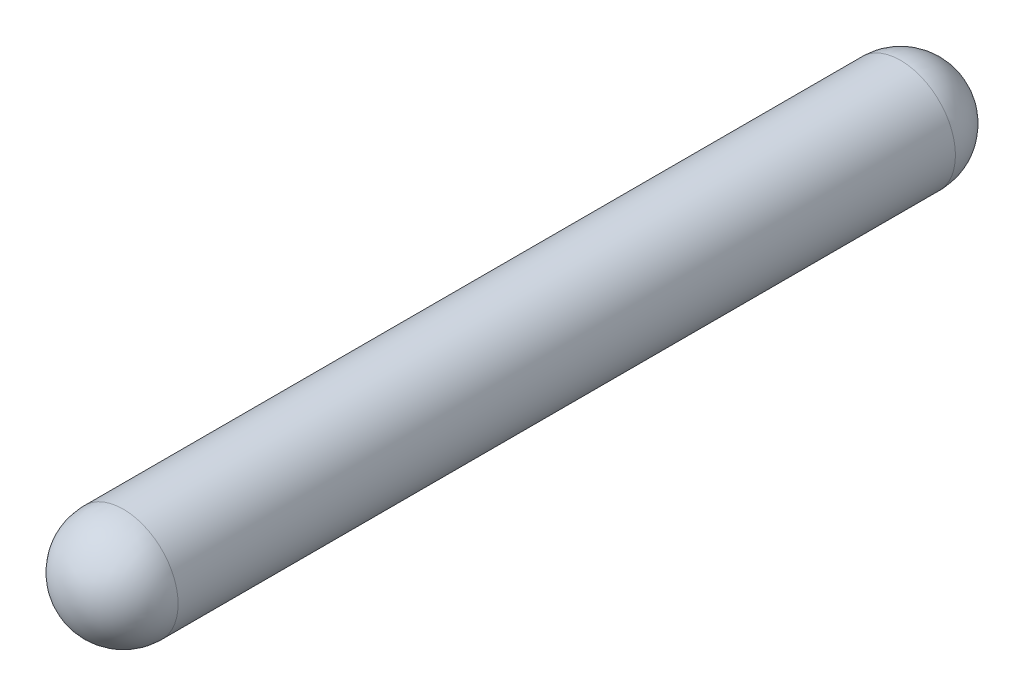
ISO-10303-21;
HEADER;
FILE_DESCRIPTION(('STEP AP214'),'2;1');
FILE_NAME('part.step','',(''),(''),'','','');
FILE_SCHEMA(('AUTOMOTIVE_DESIGN { 1 0 10303 214 1 1 1 1 }'));
ENDSEC;
DATA;
#1=APPLICATION_CONTEXT('core data for automotive mechanical design processes');
#2=APPLICATION_PROTOCOL_DEFINITION('international standard','automotive_design',2000,#1);
#3=PRODUCT_CONTEXT('',#1,'mechanical');
#4=PRODUCT('Part','Part','',(#3));
#5=PRODUCT_RELATED_PRODUCT_CATEGORY('part','',(#4));
#6=PRODUCT_DEFINITION_FORMATION('','',#4);
#7=PRODUCT_DEFINITION_CONTEXT('part definition',#1,'design');
#8=PRODUCT_DEFINITION('design','',#6,#7);
#9=PRODUCT_DEFINITION_SHAPE('','',#8);
#10=(LENGTH_UNIT() NAMED_UNIT(*) SI_UNIT(.MILLI.,.METRE.));
#11=(NAMED_UNIT(*) PLANE_ANGLE_UNIT() SI_UNIT($,.RADIAN.));
#12=(NAMED_UNIT(*) SI_UNIT($,.STERADIAN.) SOLID_ANGLE_UNIT());
#13=UNCERTAINTY_MEASURE_WITH_UNIT(LENGTH_MEASURE(1.E-05),#10,'distance_accuracy_value','');
#14=(GEOMETRIC_REPRESENTATION_CONTEXT(3) GLOBAL_UNCERTAINTY_ASSIGNED_CONTEXT((#13)) GLOBAL_UNIT_ASSIGNED_CONTEXT((#10,
#11,#12)) REPRESENTATION_CONTEXT('',''));
#15=CARTESIAN_POINT('',(0.,0.,0.));
#16=DIRECTION('',(0.,0.,1.));
#17=DIRECTION('',(1.,0.,0.));
#18=AXIS2_PLACEMENT_3D('',#15,#16,#17);
#19=CARTESIAN_POINT('',(0.,0.,-3.));
#20=DIRECTION('',(1.,0.,0.));
#21=DIRECTION('',(0.,-1.,0.));
#22=AXIS2_PLACEMENT_3D('',#19,#20,#21);
#23=SPHERICAL_SURFACE('',#22,0.458);
#24=CARTESIAN_POINT('',(0.,0.,-3.));
#25=DIRECTION('',(0.,0.,1.));
#26=DIRECTION('',(1.,0.,0.));
#27=AXIS2_PLACEMENT_3D('',#24,#25,#26);
#28=CIRCLE('',#27,0.458);
#29=CARTESIAN_POINT('',(0.458,0.,-3.));
#30=VERTEX_POINT('',#29);
#31=CARTESIAN_POINT('',(-0.458,0.,-3.));
#32=VERTEX_POINT('',#31);
#33=EDGE_CURVE('E42',#30,#32,#28,.T.);
#34=ORIENTED_EDGE('',*,*,#33,.F.);
#35=CARTESIAN_POINT('',(0.,0.,-3.));
#36=DIRECTION('',(0.,0.,1.));
#37=DIRECTION('',(1.,0.,0.));
#38=AXIS2_PLACEMENT_3D('',#35,#36,#37);
#39=CIRCLE('',#38,0.458);
#40=EDGE_CURVE('E26',#32,#30,#39,.T.);
#41=ORIENTED_EDGE('',*,*,#40,.F.);
#42=EDGE_LOOP('',(#34,#41));
#43=FACE_BOUND('',#42,.T.);
#44=ADVANCED_FACE('F17',(#43),#23,.T.);
#45=CARTESIAN_POINT('',(0.,0.,3.5));
#46=DIRECTION('',(1.,0.,0.));
#47=DIRECTION('',(0.,1.,0.));
#48=AXIS2_PLACEMENT_3D('',#45,#46,#47);
#49=SPHERICAL_SURFACE('',#48,0.458);
#50=CARTESIAN_POINT('',(0.,0.,3.5));
#51=DIRECTION('',(0.,0.,1.));
#52=DIRECTION('',(1.,0.,0.));
#53=AXIS2_PLACEMENT_3D('',#50,#51,#52);
#54=CIRCLE('',#53,0.458);
#55=CARTESIAN_POINT('',(0.458,0.,3.5));
#56=VERTEX_POINT('',#55);
#57=CARTESIAN_POINT('',(-0.458,0.,3.5));
#58=VERTEX_POINT('',#57);
#59=EDGE_CURVE('E11',#56,#58,#54,.F.);
#60=ORIENTED_EDGE('',*,*,#59,.F.);
#61=CARTESIAN_POINT('',(0.,0.,3.5));
#62=DIRECTION('',(0.,0.,1.));
#63=DIRECTION('',(1.,0.,0.));
#64=AXIS2_PLACEMENT_3D('',#61,#62,#63);
#65=CIRCLE('',#64,0.458);
#66=EDGE_CURVE('E34',#58,#56,#65,.F.);
#67=ORIENTED_EDGE('',*,*,#66,.F.);
#68=EDGE_LOOP('',(#60,#67));
#69=FACE_BOUND('',#68,.T.);
#70=ADVANCED_FACE('F49',(#69),#49,.T.);
#71=CARTESIAN_POINT('',(0.,0.,-3.));
#72=DIRECTION('',(0.,0.,1.));
#73=DIRECTION('',(1.,0.,0.));
#74=AXIS2_PLACEMENT_3D('',#71,#72,#73);
#75=CYLINDRICAL_SURFACE('',#74,0.458);
#76=ORIENTED_EDGE('',*,*,#66,.T.);
#77=ORIENTED_EDGE('',*,*,#59,.T.);
#78=EDGE_LOOP('',(#76,#77));
#79=FACE_BOUND('',#78,.T.);
#80=ORIENTED_EDGE('',*,*,#40,.T.);
#81=ORIENTED_EDGE('',*,*,#33,.T.);
#82=EDGE_LOOP('',(#80,#81));
#83=FACE_BOUND('',#82,.T.);
#84=ADVANCED_FACE('F45',(#79,#83),#75,.T.);
#85=CLOSED_SHELL('',(#44,#70,#84));
#86=MANIFOLD_SOLID_BREP('B1',#85);
#87=ADVANCED_BREP_SHAPE_REPRESENTATION('',(#18,#86),#14);
#88=SHAPE_DEFINITION_REPRESENTATION(#9,#87);
ENDSEC;
END-ISO-10303-21;
